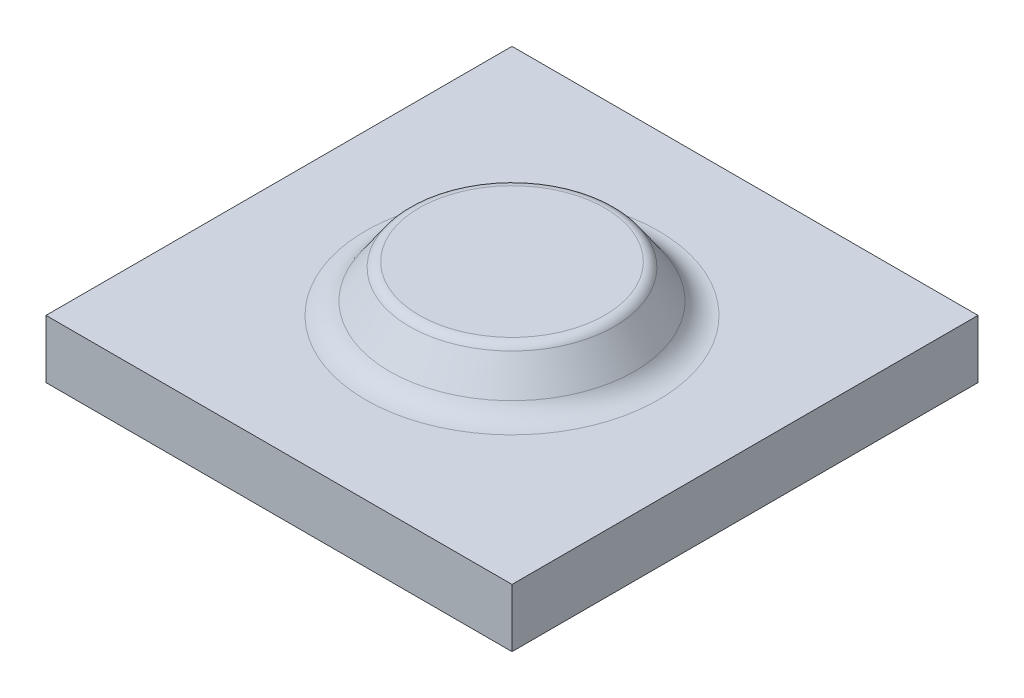
ISO-10303-21;
HEADER;
FILE_DESCRIPTION(('STEP AP214'),'2;1');
FILE_NAME('part.step','',(''),(''),'','','');
FILE_SCHEMA(('AUTOMOTIVE_DESIGN { 1 0 10303 214 1 1 1 1 }'));
ENDSEC;
DATA;
#1=APPLICATION_CONTEXT('core data for automotive mechanical design processes');
#2=APPLICATION_PROTOCOL_DEFINITION('international standard','automotive_design',2000,#1);
#3=PRODUCT_CONTEXT('',#1,'mechanical');
#4=PRODUCT('Part','Part','',(#3));
#5=PRODUCT_RELATED_PRODUCT_CATEGORY('part','',(#4));
#6=PRODUCT_DEFINITION_FORMATION('','',#4);
#7=PRODUCT_DEFINITION_CONTEXT('part definition',#1,'design');
#8=PRODUCT_DEFINITION('design','',#6,#7);
#9=PRODUCT_DEFINITION_SHAPE('','',#8);
#10=(LENGTH_UNIT() NAMED_UNIT(*) SI_UNIT(.MILLI.,.METRE.));
#11=(NAMED_UNIT(*) PLANE_ANGLE_UNIT() SI_UNIT($,.RADIAN.));
#12=(NAMED_UNIT(*) SI_UNIT($,.STERADIAN.) SOLID_ANGLE_UNIT());
#13=UNCERTAINTY_MEASURE_WITH_UNIT(LENGTH_MEASURE(1.E-05),#10,'distance_accuracy_value','');
#14=(GEOMETRIC_REPRESENTATION_CONTEXT(3) GLOBAL_UNCERTAINTY_ASSIGNED_CONTEXT((#13)) GLOBAL_UNIT_ASSIGNED_CONTEXT((#10,
#11,#12)) REPRESENTATION_CONTEXT('',''));
#15=CARTESIAN_POINT('',(0.,0.,0.));
#16=DIRECTION('',(0.,0.,1.));
#17=DIRECTION('',(1.,0.,0.));
#18=AXIS2_PLACEMENT_3D('',#15,#16,#17);
#19=CARTESIAN_POINT('',(-40.,10.,-40.));
#20=DIRECTION('',(1.,0.,0.));
#21=DIRECTION('',(0.,0.,-1.));
#22=AXIS2_PLACEMENT_3D('',#19,#20,#21);
#23=PLANE('',#22);
#24=DIRECTION('',(0.,0.,1.));
#25=VECTOR('',#24,1.);
#26=CARTESIAN_POINT('',(-40.,0.,-40.));
#27=LINE('',#26,#25);
#28=CARTESIAN_POINT('',(-40.,0.,-40.));
#29=VERTEX_POINT('',#28);
#30=CARTESIAN_POINT('',(-40.,0.,40.));
#31=VERTEX_POINT('',#30);
#32=EDGE_CURVE('E106',#29,#31,#27,.T.);
#33=ORIENTED_EDGE('',*,*,#32,.T.);
#34=DIRECTION('',(0.,-1.,0.));
#35=VECTOR('',#34,1.);
#36=CARTESIAN_POINT('',(-40.,10.,40.));
#37=LINE('',#36,#35);
#38=CARTESIAN_POINT('',(-40.,10.,40.));
#39=VERTEX_POINT('',#38);
#40=EDGE_CURVE('E97',#39,#31,#37,.T.);
#41=ORIENTED_EDGE('',*,*,#40,.F.);
#42=DIRECTION('',(0.,0.,1.));
#43=VECTOR('',#42,1.);
#44=CARTESIAN_POINT('',(-40.,10.,-40.));
#45=LINE('',#44,#43);
#46=CARTESIAN_POINT('',(-40.,10.,-40.));
#47=VERTEX_POINT('',#46);
#48=EDGE_CURVE('E91',#47,#39,#45,.T.);
#49=ORIENTED_EDGE('',*,*,#48,.F.);
#50=DIRECTION('',(0.,-1.,0.));
#51=VECTOR('',#50,1.);
#52=CARTESIAN_POINT('',(-40.,10.,-40.));
#53=LINE('',#52,#51);
#54=EDGE_CURVE('E102',#47,#29,#53,.T.);
#55=ORIENTED_EDGE('',*,*,#54,.T.);
#56=EDGE_LOOP('',(#33,#41,#49,#55));
#57=FACE_BOUND('',#56,.T.);
#58=ADVANCED_FACE('F38',(#57),#23,.F.);
#59=CARTESIAN_POINT('',(40.,10.,40.));
#60=DIRECTION('',(0.,0.,-1.));
#61=DIRECTION('',(-1.,0.,0.));
#62=AXIS2_PLACEMENT_3D('',#59,#60,#61);
#63=PLANE('',#62);
#64=DIRECTION('',(1.,0.,0.));
#65=VECTOR('',#64,1.);
#66=CARTESIAN_POINT('',(40.,0.,40.));
#67=LINE('',#66,#65);
#68=CARTESIAN_POINT('',(40.,0.,40.));
#69=VERTEX_POINT('',#68);
#70=EDGE_CURVE('E96',#31,#69,#67,.T.);
#71=ORIENTED_EDGE('',*,*,#70,.T.);
#72=DIRECTION('',(0.,-1.,0.));
#73=VECTOR('',#72,1.);
#74=CARTESIAN_POINT('',(40.,10.,40.));
#75=LINE('',#74,#73);
#76=CARTESIAN_POINT('',(40.,10.,40.));
#77=VERTEX_POINT('',#76);
#78=EDGE_CURVE('E94',#77,#69,#75,.T.);
#79=ORIENTED_EDGE('',*,*,#78,.F.);
#80=DIRECTION('',(1.,0.,0.));
#81=VECTOR('',#80,1.);
#82=CARTESIAN_POINT('',(40.,10.,40.));
#83=LINE('',#82,#81);
#84=EDGE_CURVE('E86',#39,#77,#83,.T.);
#85=ORIENTED_EDGE('',*,*,#84,.F.);
#86=ORIENTED_EDGE('',*,*,#40,.T.);
#87=EDGE_LOOP('',(#71,#79,#85,#86));
#88=FACE_BOUND('',#87,.T.);
#89=ADVANCED_FACE('F95',(#88),#63,.F.);
#90=CARTESIAN_POINT('',(40.,10.,-40.));
#91=DIRECTION('',(-1.,0.,0.));
#92=DIRECTION('',(0.,0.,1.));
#93=AXIS2_PLACEMENT_3D('',#90,#91,#92);
#94=PLANE('',#93);
#95=DIRECTION('',(0.,0.,-1.));
#96=VECTOR('',#95,1.);
#97=CARTESIAN_POINT('',(40.,0.,-40.));
#98=LINE('',#97,#96);
#99=CARTESIAN_POINT('',(40.,0.,-40.));
#100=VERTEX_POINT('',#99);
#101=EDGE_CURVE('E72',#69,#100,#98,.T.);
#102=ORIENTED_EDGE('',*,*,#101,.T.);
#103=DIRECTION('',(0.,-1.,0.));
#104=VECTOR('',#103,1.);
#105=CARTESIAN_POINT('',(40.,10.,-40.));
#106=LINE('',#105,#104);
#107=CARTESIAN_POINT('',(40.,10.,-40.));
#108=VERTEX_POINT('',#107);
#109=EDGE_CURVE('E98',#108,#100,#106,.T.);
#110=ORIENTED_EDGE('',*,*,#109,.F.);
#111=DIRECTION('',(0.,0.,-1.));
#112=VECTOR('',#111,1.);
#113=CARTESIAN_POINT('',(40.,10.,-40.));
#114=LINE('',#113,#112);
#115=EDGE_CURVE('E89',#77,#108,#114,.T.);
#116=ORIENTED_EDGE('',*,*,#115,.F.);
#117=ORIENTED_EDGE('',*,*,#78,.T.);
#118=EDGE_LOOP('',(#102,#110,#116,#117));
#119=FACE_BOUND('',#118,.T.);
#120=ADVANCED_FACE('F100',(#119),#94,.F.);
#121=CARTESIAN_POINT('',(40.,10.,-40.));
#122=DIRECTION('',(0.,0.,1.));
#123=DIRECTION('',(1.,0.,0.));
#124=AXIS2_PLACEMENT_3D('',#121,#122,#123);
#125=PLANE('',#124);
#126=DIRECTION('',(-1.,0.,0.));
#127=VECTOR('',#126,1.);
#128=CARTESIAN_POINT('',(40.,0.,-40.));
#129=LINE('',#128,#127);
#130=EDGE_CURVE('E78',#100,#29,#129,.T.);
#131=ORIENTED_EDGE('',*,*,#130,.T.);
#132=ORIENTED_EDGE('',*,*,#54,.F.);
#133=DIRECTION('',(-1.,0.,0.));
#134=VECTOR('',#133,1.);
#135=CARTESIAN_POINT('',(40.,10.,-40.));
#136=LINE('',#135,#134);
#137=EDGE_CURVE('E55',#108,#47,#136,.T.);
#138=ORIENTED_EDGE('',*,*,#137,.F.);
#139=ORIENTED_EDGE('',*,*,#109,.T.);
#140=EDGE_LOOP('',(#131,#132,#138,#139));
#141=FACE_BOUND('',#140,.T.);
#142=ADVANCED_FACE('F144',(#141),#125,.F.);
#143=CARTESIAN_POINT('',(0.,10.,0.));
#144=DIRECTION('',(0.,-1.,0.));
#145=DIRECTION('',(0.,0.,-1.));
#146=AXIS2_PLACEMENT_3D('',#143,#144,#145);
#147=PLANE('',#146);
#148=CARTESIAN_POINT('',(0.,10.,0.));
#149=DIRECTION('',(0.,-1.,0.));
#150=DIRECTION('',(0.,0.,-1.));
#151=AXIS2_PLACEMENT_3D('',#148,#149,#150);
#152=CIRCLE('',#151,25.1301524496711);
#153=CARTESIAN_POINT('',(0.,10.,-25.1301524496711));
#154=VERTEX_POINT('',#153);
#155=EDGE_CURVE('E115',#154,#154,#152,.T.);
#156=ORIENTED_EDGE('',*,*,#155,.T.);
#157=EDGE_LOOP('',(#156));
#158=FACE_BOUND('',#157,.T.);
#159=ORIENTED_EDGE('',*,*,#48,.T.);
#160=ORIENTED_EDGE('',*,*,#84,.T.);
#161=ORIENTED_EDGE('',*,*,#115,.T.);
#162=ORIENTED_EDGE('',*,*,#137,.T.);
#163=EDGE_LOOP('',(#159,#160,#161,#162));
#164=FACE_BOUND('',#163,.T.);
#165=ADVANCED_FACE('F87',(#158,#164),#147,.F.);
#166=CARTESIAN_POINT('',(0.,0.,0.));
#167=DIRECTION('',(0.,-1.,0.));
#168=DIRECTION('',(0.,0.,-1.));
#169=AXIS2_PLACEMENT_3D('',#166,#167,#168);
#170=PLANE('',#169);
#171=ORIENTED_EDGE('',*,*,#32,.F.);
#172=ORIENTED_EDGE('',*,*,#130,.F.);
#173=ORIENTED_EDGE('',*,*,#101,.F.);
#174=ORIENTED_EDGE('',*,*,#70,.F.);
#175=EDGE_LOOP('',(#171,#172,#173,#174));
#176=FACE_BOUND('',#175,.T.);
#177=ADVANCED_FACE('F147',(#176),#170,.T.);
#178=CARTESIAN_POINT('',(17.,18.,0.));
#179=DIRECTION('',(0.,1.,0.));
#180=DIRECTION('',(0.,0.,1.));
#181=AXIS2_PLACEMENT_3D('',#178,#179,#180);
#182=PLANE('',#181);
#183=CARTESIAN_POINT('',(0.,18.,0.));
#184=DIRECTION('',(0.,1.,0.));
#185=DIRECTION('',(0.,0.,1.));
#186=AXIS2_PLACEMENT_3D('',#183,#184,#185);
#187=CIRCLE('',#186,15.9479390201316);
#188=CARTESIAN_POINT('',(0.,18.,15.9479390201316));
#189=VERTEX_POINT('',#188);
#190=EDGE_CURVE('E12',#189,#189,#187,.T.);
#191=ORIENTED_EDGE('',*,*,#190,.T.);
#192=EDGE_LOOP('',(#191));
#193=FACE_BOUND('',#192,.T.);
#194=ADVANCED_FACE('F150',(#193),#182,.T.);
#195=CARTESIAN_POINT('',(0.,10.,0.));
#196=DIRECTION('',(0.,-1.,0.));
#197=DIRECTION('',(0.,0.,-1.));
#198=AXIS2_PLACEMENT_3D('',#195,#196,#197);
#199=CONICAL_SURFACE('',#198,22.5,0.602287346134964);
#200=CARTESIAN_POINT('',(0.,17.1330576457741,0.));
#201=DIRECTION('',(0.,1.,0.));
#202=DIRECTION('',(0.,0.,1.));
#203=AXIS2_PLACEMENT_3D('',#200,#201,#202);
#204=CIRCLE('',#203,17.5960228685303);
#205=CARTESIAN_POINT('',(0.,17.1330576457741,17.5960228685303));
#206=VERTEX_POINT('',#205);
#207=EDGE_CURVE('E47',#206,#206,#204,.F.);
#208=ORIENTED_EDGE('',*,*,#207,.T.);
#209=EDGE_LOOP('',(#208));
#210=FACE_BOUND('',#209,.T.);
#211=CARTESIAN_POINT('',(0.,12.1673558855647,0.));
#212=DIRECTION('',(0.,1.,0.));
#213=DIRECTION('',(0.,0.,1.));
#214=AXIS2_PLACEMENT_3D('',#211,#212,#213);
#215=CIRCLE('',#214,21.0099428286743);
#216=CARTESIAN_POINT('',(0.,12.1673558855647,21.0099428286743));
#217=VERTEX_POINT('',#216);
#218=EDGE_CURVE('E118',#217,#217,#215,.T.);
#219=ORIENTED_EDGE('',*,*,#218,.T.);
#220=EDGE_LOOP('',(#219));
#221=FACE_BOUND('',#220,.T.);
#222=ADVANCED_FACE('F123',(#210,#221),#199,.T.);
#223=CARTESIAN_POINT('',(0.,15.,0.));
#224=DIRECTION('',(0.,-1.,0.));
#225=DIRECTION('',(0.,0.,-1.));
#226=AXIS2_PLACEMENT_3D('',#223,#224,#225);
#227=TOROIDAL_SURFACE('',#226,25.1301524496711,5.);
#228=ORIENTED_EDGE('',*,*,#218,.F.);
#229=EDGE_LOOP('',(#228));
#230=FACE_BOUND('',#229,.T.);
#231=ORIENTED_EDGE('',*,*,#155,.F.);
#232=EDGE_LOOP('',(#231));
#233=FACE_BOUND('',#232,.T.);
#234=ADVANCED_FACE('F127',(#230,#233),#227,.F.);
#235=CARTESIAN_POINT('',(0.,16.,0.));
#236=DIRECTION('',(0.,1.,0.));
#237=DIRECTION('',(0.,0.,1.));
#238=AXIS2_PLACEMENT_3D('',#235,#236,#237);
#239=TOROIDAL_SURFACE('',#238,15.9479390201316,2.);
#240=ORIENTED_EDGE('',*,*,#190,.F.);
#241=EDGE_LOOP('',(#240));
#242=FACE_BOUND('',#241,.T.);
#243=ORIENTED_EDGE('',*,*,#207,.F.);
#244=EDGE_LOOP('',(#243));
#245=FACE_BOUND('',#244,.T.);
#246=ADVANCED_FACE('F40',(#242,#245),#239,.T.);
#247=CLOSED_SHELL('',(#58,#89,#120,#142,#165,#177,#194,#222,#234,#246));
#248=MANIFOLD_SOLID_BREP('B2',#247);
#249=ADVANCED_BREP_SHAPE_REPRESENTATION('',(#18,#248),#14);
#250=SHAPE_DEFINITION_REPRESENTATION(#9,#249);
ENDSEC;
END-ISO-10303-21;
